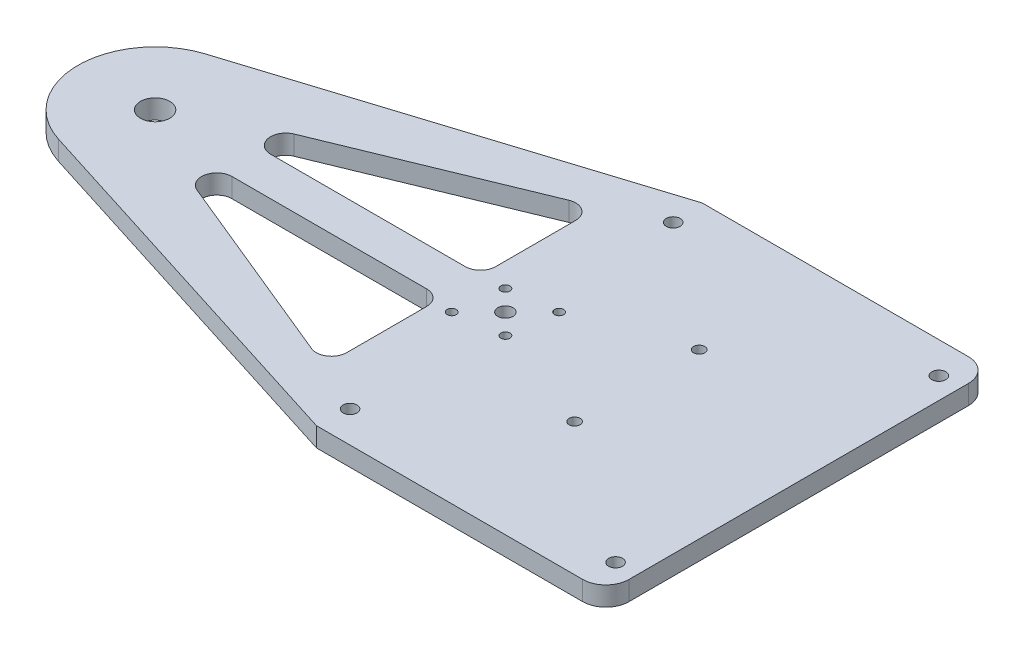
ISO-10303-21;
HEADER;
FILE_DESCRIPTION(('STEP AP214'),'2;1');
FILE_NAME('part.step','',(''),(''),'','','');
FILE_SCHEMA(('AUTOMOTIVE_DESIGN { 1 0 10303 214 1 1 1 1 }'));
ENDSEC;
DATA;
#1=APPLICATION_CONTEXT('core data for automotive mechanical design processes');
#2=APPLICATION_PROTOCOL_DEFINITION('international standard','automotive_design',2000,#1);
#3=PRODUCT_CONTEXT('',#1,'mechanical');
#4=PRODUCT('Part','Part','',(#3));
#5=PRODUCT_RELATED_PRODUCT_CATEGORY('part','',(#4));
#6=PRODUCT_DEFINITION_FORMATION('','',#4);
#7=PRODUCT_DEFINITION_CONTEXT('part definition',#1,'design');
#8=PRODUCT_DEFINITION('design','',#6,#7);
#9=PRODUCT_DEFINITION_SHAPE('','',#8);
#10=(LENGTH_UNIT() NAMED_UNIT(*) SI_UNIT(.MILLI.,.METRE.));
#11=(NAMED_UNIT(*) PLANE_ANGLE_UNIT() SI_UNIT($,.RADIAN.));
#12=(NAMED_UNIT(*) SI_UNIT($,.STERADIAN.) SOLID_ANGLE_UNIT());
#13=UNCERTAINTY_MEASURE_WITH_UNIT(LENGTH_MEASURE(1.E-05),#10,'distance_accuracy_value','');
#14=(GEOMETRIC_REPRESENTATION_CONTEXT(3) GLOBAL_UNCERTAINTY_ASSIGNED_CONTEXT((#13)) GLOBAL_UNIT_ASSIGNED_CONTEXT((#10,
#11,#12)) REPRESENTATION_CONTEXT('',''));
#15=CARTESIAN_POINT('',(0.,0.,0.));
#16=DIRECTION('',(0.,0.,1.));
#17=DIRECTION('',(1.,0.,0.));
#18=AXIS2_PLACEMENT_3D('',#15,#16,#17);
#19=CARTESIAN_POINT('',(47.625,6.35,63.5));
#20=DIRECTION('',(-1.,0.,0.));
#21=DIRECTION('',(0.,0.,1.));
#22=AXIS2_PLACEMENT_3D('',#19,#20,#21);
#23=PLANE('',#22);
#24=DIRECTION('',(0.,0.,-1.));
#25=VECTOR('',#24,1.);
#26=CARTESIAN_POINT('',(47.625,6.35,63.5));
#27=LINE('',#26,#25);
#28=CARTESIAN_POINT('',(47.625,6.35,55.88));
#29=VERTEX_POINT('',#28);
#30=CARTESIAN_POINT('',(47.625,6.35,-55.88));
#31=VERTEX_POINT('',#30);
#32=EDGE_CURVE('E225',#29,#31,#27,.T.);
#33=ORIENTED_EDGE('',*,*,#32,.F.);
#34=DIRECTION('',(0.,-1.,0.));
#35=VECTOR('',#34,1.);
#36=CARTESIAN_POINT('',(47.625,6.35,55.88));
#37=LINE('',#36,#35);
#38=CARTESIAN_POINT('',(47.625,0.,55.88));
#39=VERTEX_POINT('',#38);
#40=EDGE_CURVE('E290',#29,#39,#37,.T.);
#41=ORIENTED_EDGE('',*,*,#40,.T.);
#42=DIRECTION('',(0.,0.,-1.));
#43=VECTOR('',#42,1.);
#44=CARTESIAN_POINT('',(47.625,0.,63.5));
#45=LINE('',#44,#43);
#46=CARTESIAN_POINT('',(47.625,0.,-55.88));
#47=VERTEX_POINT('',#46);
#48=EDGE_CURVE('E187',#39,#47,#45,.T.);
#49=ORIENTED_EDGE('',*,*,#48,.T.);
#50=DIRECTION('',(0.,-1.,0.));
#51=VECTOR('',#50,1.);
#52=CARTESIAN_POINT('',(47.625,6.35,-55.88));
#53=LINE('',#52,#51);
#54=EDGE_CURVE('E288',#47,#31,#53,.F.);
#55=ORIENTED_EDGE('',*,*,#54,.T.);
#56=EDGE_LOOP('',(#33,#41,#49,#55));
#57=FACE_BOUND('',#56,.T.);
#58=ADVANCED_FACE('F39',(#57),#23,.F.);
#59=CARTESIAN_POINT('',(-47.625,6.35,-63.5));
#60=DIRECTION('',(0.,0.,1.));
#61=DIRECTION('',(1.,0.,0.));
#62=AXIS2_PLACEMENT_3D('',#59,#60,#61);
#63=PLANE('',#62);
#64=DIRECTION('',(-1.,0.,0.));
#65=VECTOR('',#64,1.);
#66=CARTESIAN_POINT('',(-47.625,6.35,-63.5));
#67=LINE('',#66,#65);
#68=CARTESIAN_POINT('',(40.005,6.35,-63.5));
#69=VERTEX_POINT('',#68);
#70=CARTESIAN_POINT('',(-47.625,6.35,-63.5));
#71=VERTEX_POINT('',#70);
#72=EDGE_CURVE('E227',#69,#71,#67,.T.);
#73=ORIENTED_EDGE('',*,*,#72,.F.);
#74=DIRECTION('',(0.,-1.,0.));
#75=VECTOR('',#74,1.);
#76=CARTESIAN_POINT('',(40.005,6.35,-63.5));
#77=LINE('',#76,#75);
#78=CARTESIAN_POINT('',(40.005,0.,-63.5));
#79=VERTEX_POINT('',#78);
#80=EDGE_CURVE('E11',#69,#79,#77,.T.);
#81=ORIENTED_EDGE('',*,*,#80,.T.);
#82=DIRECTION('',(-1.,0.,0.));
#83=VECTOR('',#82,1.);
#84=CARTESIAN_POINT('',(-47.625,0.,-63.5));
#85=LINE('',#84,#83);
#86=CARTESIAN_POINT('',(-47.625,0.,-63.5));
#87=VERTEX_POINT('',#86);
#88=EDGE_CURVE('E178',#79,#87,#85,.T.);
#89=ORIENTED_EDGE('',*,*,#88,.T.);
#90=DIRECTION('',(0.,-1.,0.));
#91=VECTOR('',#90,1.);
#92=CARTESIAN_POINT('',(-47.625,6.35,-63.5));
#93=LINE('',#92,#91);
#94=EDGE_CURVE('E181',#71,#87,#93,.T.);
#95=ORIENTED_EDGE('',*,*,#94,.F.);
#96=EDGE_LOOP('',(#73,#81,#89,#95));
#97=FACE_BOUND('',#96,.T.);
#98=ADVANCED_FACE('F180',(#97),#63,.F.);
#99=CARTESIAN_POINT('',(-47.625,6.35,63.5));
#100=DIRECTION('',(0.,0.,-1.));
#101=DIRECTION('',(-1.,0.,0.));
#102=AXIS2_PLACEMENT_3D('',#99,#100,#101);
#103=PLANE('',#102);
#104=DIRECTION('',(1.,0.,0.));
#105=VECTOR('',#104,1.);
#106=CARTESIAN_POINT('',(-47.625,0.,63.5));
#107=LINE('',#106,#105);
#108=CARTESIAN_POINT('',(-47.625,0.,63.5));
#109=VERTEX_POINT('',#108);
#110=CARTESIAN_POINT('',(40.005,0.,63.5));
#111=VERTEX_POINT('',#110);
#112=EDGE_CURVE('E186',#109,#111,#107,.T.);
#113=ORIENTED_EDGE('',*,*,#112,.T.);
#114=DIRECTION('',(0.,-1.,0.));
#115=VECTOR('',#114,1.);
#116=CARTESIAN_POINT('',(40.005,6.35,63.5));
#117=LINE('',#116,#115);
#118=CARTESIAN_POINT('',(40.005,6.35,63.5));
#119=VERTEX_POINT('',#118);
#120=EDGE_CURVE('E62',#111,#119,#117,.F.);
#121=ORIENTED_EDGE('',*,*,#120,.T.);
#122=DIRECTION('',(1.,0.,0.));
#123=VECTOR('',#122,1.);
#124=CARTESIAN_POINT('',(-47.625,6.35,63.5));
#125=LINE('',#124,#123);
#126=CARTESIAN_POINT('',(-47.625,6.35,63.5));
#127=VERTEX_POINT('',#126);
#128=EDGE_CURVE('E229',#127,#119,#125,.T.);
#129=ORIENTED_EDGE('',*,*,#128,.F.);
#130=DIRECTION('',(0.,-1.,0.));
#131=VECTOR('',#130,1.);
#132=CARTESIAN_POINT('',(-47.625,6.35,63.5));
#133=LINE('',#132,#131);
#134=EDGE_CURVE('E196',#127,#109,#133,.T.);
#135=ORIENTED_EDGE('',*,*,#134,.T.);
#136=EDGE_LOOP('',(#113,#121,#129,#135));
#137=FACE_BOUND('',#136,.T.);
#138=ADVANCED_FACE('F307',(#137),#103,.F.);
#139=CARTESIAN_POINT('',(0.,6.35,0.));
#140=DIRECTION('',(0.,-1.,0.));
#141=DIRECTION('',(0.,0.,-1.));
#142=AXIS2_PLACEMENT_3D('',#139,#140,#141);
#143=PLANE('',#142);
#144=CARTESIAN_POINT('',(-6.32846504664037,6.35,19.8289248425364));
#145=DIRECTION('',(0.,1.,0.));
#146=DIRECTION('',(0.,0.,1.));
#147=AXIS2_PLACEMENT_3D('',#144,#145,#146);
#148=CIRCLE('',#147,1.83000808299);
#149=CARTESIAN_POINT('',(-6.32846504664037,6.35,21.6589329255264));
#150=VERTEX_POINT('',#149);
#151=EDGE_CURVE('E531',#150,#150,#148,.T.);
#152=ORIENTED_EDGE('',*,*,#151,.F.);
#153=EDGE_LOOP('',(#152));
#154=FACE_BOUND('',#153,.T.);
#155=CARTESIAN_POINT('',(-6.32833804564912,6.35,-21.1714909607088));
#156=DIRECTION('',(0.,1.,0.));
#157=DIRECTION('',(0.,0.,1.));
#158=AXIS2_PLACEMENT_3D('',#155,#156,#157);
#159=CIRCLE('',#158,1.83000808299);
#160=CARTESIAN_POINT('',(-6.32833804564912,6.35,-19.3414828777188));
#161=VERTEX_POINT('',#160);
#162=EDGE_CURVE('E525',#161,#161,#159,.T.);
#163=ORIENTED_EDGE('',*,*,#162,.F.);
#164=EDGE_LOOP('',(#163));
#165=FACE_BOUND('',#164,.T.);
#166=CARTESIAN_POINT('',(40.53961409898,6.35,53.2203604808211));
#167=DIRECTION('',(0.,1.,0.));
#168=DIRECTION('',(0.,0.,1.));
#169=AXIS2_PLACEMENT_3D('',#166,#167,#168);
#170=CIRCLE('',#169,2.2812375);
#171=CARTESIAN_POINT('',(40.53961409898,6.35,55.5015979808211));
#172=VERTEX_POINT('',#171);
#173=EDGE_CURVE('E507',#172,#172,#170,.T.);
#174=ORIENTED_EDGE('',*,*,#173,.F.);
#175=EDGE_LOOP('',(#174));
#176=FACE_BOUND('',#175,.T.);
#177=CARTESIAN_POINT('',(40.5570335523335,6.35,-53.1901891025738));
#178=DIRECTION('',(0.,1.,0.));
#179=DIRECTION('',(0.,0.,1.));
#180=AXIS2_PLACEMENT_3D('',#177,#178,#179);
#181=CIRCLE('',#180,2.2812375);
#182=CARTESIAN_POINT('',(40.5570335523335,6.35,-50.9089516025738));
#183=VERTEX_POINT('',#182);
#184=EDGE_CURVE('E514',#183,#183,#181,.T.);
#185=ORIENTED_EDGE('',*,*,#184,.F.);
#186=EDGE_LOOP('',(#185));
#187=FACE_BOUND('',#186,.T.);
#188=CARTESIAN_POINT('',(-46.8896140989806,6.35,-53.1801319764913));
#189=DIRECTION('',(0.,1.,0.));
#190=DIRECTION('',(0.,0.,1.));
#191=AXIS2_PLACEMENT_3D('',#188,#189,#190);
#192=CIRCLE('',#191,2.2812375);
#193=CARTESIAN_POINT('',(-46.8896140989806,6.35,-50.8988944764913));
#194=VERTEX_POINT('',#193);
#195=EDGE_CURVE('E520',#194,#194,#192,.T.);
#196=ORIENTED_EDGE('',*,*,#195,.F.);
#197=EDGE_LOOP('',(#196));
#198=FACE_BOUND('',#197,.T.);
#199=CARTESIAN_POINT('',(-46.8896140989806,6.35,53.2002462286562));
#200=DIRECTION('',(0.,1.,0.));
#201=DIRECTION('',(0.,0.,1.));
#202=AXIS2_PLACEMENT_3D('',#199,#200,#201);
#203=CIRCLE('',#202,2.2812375);
#204=CARTESIAN_POINT('',(-46.8896140989806,6.35,55.4814837286562));
#205=VERTEX_POINT('',#204);
#206=EDGE_CURVE('E501',#205,#205,#203,.T.);
#207=ORIENTED_EDGE('',*,*,#206,.F.);
#208=EDGE_LOOP('',(#207));
#209=FACE_BOUND('',#208,.T.);
#210=DIRECTION('',(-0.924890770713384,0.,0.380232905268865));
#211=VECTOR('',#210,1.);
#212=CARTESIAN_POINT('',(-63.5,6.35,-45.1637433547681));
#213=LINE('',#212,#211);
#214=CARTESIAN_POINT('',(-70.4011645263443,6.35,-42.3265976931606));
#215=VERTEX_POINT('',#214);
#216=CARTESIAN_POINT('',(-134.500968325591,6.35,-15.9744538535669));
#217=VERTEX_POINT('',#216);
#218=EDGE_CURVE('E489',#215,#217,#213,.T.);
#219=ORIENTED_EDGE('',*,*,#218,.F.);
#220=CARTESIAN_POINT('',(-68.5,6.35,-37.7021438395937));
#221=DIRECTION('',(0.,-1.,0.));
#222=DIRECTION('',(0.,0.,-1.));
#223=AXIS2_PLACEMENT_3D('',#220,#221,#222);
#224=CIRCLE('',#223,5.);
#225=CARTESIAN_POINT('',(-63.5,6.35,-37.7021438395937));
#226=VERTEX_POINT('',#225);
#227=EDGE_CURVE('E284',#215,#226,#224,.T.);
#228=ORIENTED_EDGE('',*,*,#227,.T.);
#229=DIRECTION('',(0.,0.,-1.));
#230=VECTOR('',#229,1.);
#231=CARTESIAN_POINT('',(-63.5,6.35,-6.34999999999999));
#232=LINE('',#231,#230);
#233=CARTESIAN_POINT('',(-63.5,6.35,-11.35));
#234=VERTEX_POINT('',#233);
#235=EDGE_CURVE('E479',#234,#226,#232,.T.);
#236=ORIENTED_EDGE('',*,*,#235,.F.);
#237=CARTESIAN_POINT('',(-68.5,6.35,-11.35));
#238=DIRECTION('',(0.,-1.,0.));
#239=DIRECTION('',(0.,0.,-1.));
#240=AXIS2_PLACEMENT_3D('',#237,#238,#239);
#241=CIRCLE('',#240,5.);
#242=CARTESIAN_POINT('',(-68.5,6.35,-6.34999999999999));
#243=VERTEX_POINT('',#242);
#244=EDGE_CURVE('E276',#234,#243,#241,.T.);
#245=ORIENTED_EDGE('',*,*,#244,.T.);
#246=DIRECTION('',(1.,0.,0.));
#247=VECTOR('',#246,1.);
#248=CARTESIAN_POINT('',(-157.9118,6.35,-6.34999999999997));
#249=LINE('',#248,#247);
#250=CARTESIAN_POINT('',(-132.599803799247,6.35,-6.34999999999998));
#251=VERTEX_POINT('',#250);
#252=EDGE_CURVE('E485',#251,#243,#249,.T.);
#253=ORIENTED_EDGE('',*,*,#252,.F.);
#254=CARTESIAN_POINT('',(-132.599803799247,6.35,-11.35));
#255=DIRECTION('',(0.,-1.,0.));
#256=DIRECTION('',(0.,0.,-1.));
#257=AXIS2_PLACEMENT_3D('',#254,#255,#256);
#258=CIRCLE('',#257,5.);
#259=EDGE_CURVE('E280',#251,#217,#258,.T.);
#260=ORIENTED_EDGE('',*,*,#259,.T.);
#261=EDGE_LOOP('',(#219,#228,#236,#245,#253,#260));
#262=FACE_BOUND('',#261,.T.);
#263=DIRECTION('',(0.924890770713385,0.,0.380232905268865));
#264=VECTOR('',#263,1.);
#265=CARTESIAN_POINT('',(-63.5,6.35,45.1637433547681));
#266=LINE('',#265,#264);
#267=CARTESIAN_POINT('',(-134.500968325591,6.35,15.9744538535669));
#268=VERTEX_POINT('',#267);
#269=CARTESIAN_POINT('',(-70.4011645263443,6.35,42.3265976931606));
#270=VERTEX_POINT('',#269);
#271=EDGE_CURVE('E469',#268,#270,#266,.T.);
#272=ORIENTED_EDGE('',*,*,#271,.F.);
#273=CARTESIAN_POINT('',(-132.599803799247,6.35,11.35));
#274=DIRECTION('',(0.,-1.,0.));
#275=DIRECTION('',(0.,0.,-1.));
#276=AXIS2_PLACEMENT_3D('',#273,#274,#275);
#277=CIRCLE('',#276,5.);
#278=CARTESIAN_POINT('',(-132.599803799247,6.35,6.35000000000001));
#279=VERTEX_POINT('',#278);
#280=EDGE_CURVE('E264',#268,#279,#277,.T.);
#281=ORIENTED_EDGE('',*,*,#280,.T.);
#282=DIRECTION('',(-1.,0.,0.));
#283=VECTOR('',#282,1.);
#284=CARTESIAN_POINT('',(-157.9118,6.35,6.35000000000001));
#285=LINE('',#284,#283);
#286=CARTESIAN_POINT('',(-68.5,6.35,6.35000000000001));
#287=VERTEX_POINT('',#286);
#288=EDGE_CURVE('E472',#287,#279,#285,.T.);
#289=ORIENTED_EDGE('',*,*,#288,.F.);
#290=CARTESIAN_POINT('',(-68.5,6.35,11.35));
#291=DIRECTION('',(0.,-1.,0.));
#292=DIRECTION('',(0.,0.,-1.));
#293=AXIS2_PLACEMENT_3D('',#290,#291,#292);
#294=CIRCLE('',#293,5.);
#295=CARTESIAN_POINT('',(-63.5,6.35,11.35));
#296=VERTEX_POINT('',#295);
#297=EDGE_CURVE('E268',#287,#296,#294,.T.);
#298=ORIENTED_EDGE('',*,*,#297,.T.);
#299=DIRECTION('',(0.,0.,-1.));
#300=VECTOR('',#299,1.);
#301=CARTESIAN_POINT('',(-63.5,6.35,6.35000000000001));
#302=LINE('',#301,#300);
#303=CARTESIAN_POINT('',(-63.5,6.35,37.7021438395937));
#304=VERTEX_POINT('',#303);
#305=EDGE_CURVE('E465',#304,#296,#302,.T.);
#306=ORIENTED_EDGE('',*,*,#305,.F.);
#307=CARTESIAN_POINT('',(-68.5,6.35,37.7021438395937));
#308=DIRECTION('',(0.,-1.,0.));
#309=DIRECTION('',(0.,0.,-1.));
#310=AXIS2_PLACEMENT_3D('',#307,#308,#309);
#311=CIRCLE('',#310,5.);
#312=EDGE_CURVE('E272',#304,#270,#311,.T.);
#313=ORIENTED_EDGE('',*,*,#312,.T.);
#314=EDGE_LOOP('',(#272,#281,#289,#298,#306,#313));
#315=FACE_BOUND('',#314,.T.);
#316=CARTESIAN_POINT('',(-164.2618,6.35,0.));
#317=DIRECTION('',(0.,1.,0.));
#318=DIRECTION('',(0.,0.,1.));
#319=AXIS2_PLACEMENT_3D('',#316,#317,#318);
#320=CIRCLE('',#319,4.82599999999999);
#321=CARTESIAN_POINT('',(-164.2618,6.35,4.82599999999999));
#322=VERTEX_POINT('',#321);
#323=EDGE_CURVE('E454',#322,#322,#320,.T.);
#324=ORIENTED_EDGE('',*,*,#323,.F.);
#325=EDGE_LOOP('',(#324));
#326=FACE_BOUND('',#325,.T.);
#327=CARTESIAN_POINT('',(-42.2282855787278,6.35,6.71751442127221));
#328=DIRECTION('',(0.,1.,0.));
#329=DIRECTION('',(0.,0.,1.));
#330=AXIS2_PLACEMENT_3D('',#327,#328,#329);
#331=CIRCLE('',#330,1.50000000000004);
#332=CARTESIAN_POINT('',(-42.2282855787278,6.35,8.21751442127225));
#333=VERTEX_POINT('',#332);
#334=EDGE_CURVE('E438',#333,#333,#331,.T.);
#335=ORIENTED_EDGE('',*,*,#334,.F.);
#336=EDGE_LOOP('',(#335));
#337=FACE_BOUND('',#336,.T.);
#338=CARTESIAN_POINT('',(-55.6633144212722,6.35,-6.71751442127223));
#339=DIRECTION('',(0.,1.,0.));
#340=DIRECTION('',(0.,0.,1.));
#341=AXIS2_PLACEMENT_3D('',#338,#339,#340);
#342=CIRCLE('',#341,1.50000000000004);
#343=CARTESIAN_POINT('',(-55.6633144212722,6.35,-5.21751442127219));
#344=VERTEX_POINT('',#343);
#345=EDGE_CURVE('E432',#344,#344,#342,.T.);
#346=ORIENTED_EDGE('',*,*,#345,.F.);
#347=EDGE_LOOP('',(#346));
#348=FACE_BOUND('',#347,.T.);
#349=CARTESIAN_POINT('',(-57.7846347648318,6.35,8.83883476483181));
#350=DIRECTION('',(0.,1.,0.));
#351=DIRECTION('',(0.,0.,1.));
#352=AXIS2_PLACEMENT_3D('',#349,#350,#351);
#353=CIRCLE('',#352,1.50000000000004);
#354=CARTESIAN_POINT('',(-57.7846347648318,6.35,10.3388347648319));
#355=VERTEX_POINT('',#354);
#356=EDGE_CURVE('E436',#355,#355,#353,.T.);
#357=ORIENTED_EDGE('',*,*,#356,.F.);
#358=EDGE_LOOP('',(#357));
#359=FACE_BOUND('',#358,.T.);
#360=CARTESIAN_POINT('',(-40.1069652351681,6.35,-8.83883476483183));
#361=DIRECTION('',(0.,1.,0.));
#362=DIRECTION('',(0.,0.,1.));
#363=AXIS2_PLACEMENT_3D('',#360,#361,#362);
#364=CIRCLE('',#363,1.50000000000004);
#365=CARTESIAN_POINT('',(-40.1069652351681,6.35,-7.33883476483179));
#366=VERTEX_POINT('',#365);
#367=EDGE_CURVE('E445',#366,#366,#364,.T.);
#368=ORIENTED_EDGE('',*,*,#367,.F.);
#369=EDGE_LOOP('',(#368));
#370=FACE_BOUND('',#369,.T.);
#371=CARTESIAN_POINT('',(-48.9458,6.35,0.));
#372=DIRECTION('',(0.,1.,0.));
#373=DIRECTION('',(0.,0.,1.));
#374=AXIS2_PLACEMENT_3D('',#371,#372,#373);
#375=CIRCLE('',#374,2.5);
#376=CARTESIAN_POINT('',(-48.9458,6.35,2.5));
#377=VERTEX_POINT('',#376);
#378=EDGE_CURVE('E451',#377,#377,#375,.T.);
#379=ORIENTED_EDGE('',*,*,#378,.F.);
#380=EDGE_LOOP('',(#379));
#381=FACE_BOUND('',#380,.T.);
#382=ORIENTED_EDGE('',*,*,#128,.T.);
#383=CARTESIAN_POINT('',(40.005,6.35,55.88));
#384=DIRECTION('',(0.,-1.,0.));
#385=DIRECTION('',(0.,0.,-1.));
#386=AXIS2_PLACEMENT_3D('',#383,#384,#385);
#387=CIRCLE('',#386,7.62);
#388=EDGE_CURVE('E47',#119,#29,#387,.F.);
#389=ORIENTED_EDGE('',*,*,#388,.T.);
#390=ORIENTED_EDGE('',*,*,#32,.T.);
#391=CARTESIAN_POINT('',(40.005,6.35,-55.88));
#392=DIRECTION('',(0.,-1.,0.));
#393=DIRECTION('',(0.,0.,-1.));
#394=AXIS2_PLACEMENT_3D('',#391,#392,#393);
#395=CIRCLE('',#394,7.62);
#396=EDGE_CURVE('E54',#31,#69,#395,.F.);
#397=ORIENTED_EDGE('',*,*,#396,.T.);
#398=ORIENTED_EDGE('',*,*,#72,.T.);
#399=DIRECTION('',(-0.953514489025035,0.,0.301347173903003));
#400=VECTOR('',#399,1.);
#401=CARTESIAN_POINT('',(-47.625,6.35,-63.5));
#402=LINE('',#401,#400);
#403=CARTESIAN_POINT('',(-171.916018217136,6.35,-24.2192680212359));
#404=VERTEX_POINT('',#403);
#405=EDGE_CURVE('E194',#71,#404,#402,.T.);
#406=ORIENTED_EDGE('',*,*,#405,.T.);
#407=CARTESIAN_POINT('',(-164.2618,6.35,0.));
#408=DIRECTION('',(0.,1.,0.));
#409=DIRECTION('',(0.,0.,1.));
#410=AXIS2_PLACEMENT_3D('',#407,#408,#409);
#411=CIRCLE('',#410,25.4);
#412=CARTESIAN_POINT('',(-171.916018217136,6.35,24.2192680212359));
#413=VERTEX_POINT('',#412);
#414=EDGE_CURVE('E209',#404,#413,#411,.T.);
#415=ORIENTED_EDGE('',*,*,#414,.T.);
#416=DIRECTION('',(0.953514489025035,0.,0.301347173903003));
#417=VECTOR('',#416,1.);
#418=CARTESIAN_POINT('',(-47.625,6.35,63.5));
#419=LINE('',#418,#417);
#420=EDGE_CURVE('E204',#413,#127,#419,.T.);
#421=ORIENTED_EDGE('',*,*,#420,.T.);
#422=EDGE_LOOP('',(#382,#389,#390,#397,#398,#406,#415,#421));
#423=FACE_BOUND('',#422,.T.);
#424=ADVANCED_FACE('F300',(#154,#165,#176,#187,#198,#209,#262,#315,#326,#337,#348,#359,#370,
#381,#423),#143,.F.);
#425=CARTESIAN_POINT('',(0.,0.,0.));
#426=DIRECTION('',(0.,-1.,0.));
#427=DIRECTION('',(0.,0.,-1.));
#428=AXIS2_PLACEMENT_3D('',#425,#426,#427);
#429=PLANE('',#428);
#430=CARTESIAN_POINT('',(-6.32846504664037,0.,19.8289248425364));
#431=DIRECTION('',(0.,1.,0.));
#432=DIRECTION('',(0.,0.,1.));
#433=AXIS2_PLACEMENT_3D('',#430,#431,#432);
#434=CIRCLE('',#433,1.83000808299);
#435=CARTESIAN_POINT('',(-6.32846504664037,0.,21.6589329255264));
#436=VERTEX_POINT('',#435);
#437=EDGE_CURVE('E511',#436,#436,#434,.T.);
#438=ORIENTED_EDGE('',*,*,#437,.T.);
#439=EDGE_LOOP('',(#438));
#440=FACE_BOUND('',#439,.T.);
#441=CARTESIAN_POINT('',(-6.32833804564912,0.,-21.1714909607088));
#442=DIRECTION('',(0.,1.,0.));
#443=DIRECTION('',(0.,0.,1.));
#444=AXIS2_PLACEMENT_3D('',#441,#442,#443);
#445=CIRCLE('',#444,1.83000808299);
#446=CARTESIAN_POINT('',(-6.32833804564912,0.,-19.3414828777188));
#447=VERTEX_POINT('',#446);
#448=EDGE_CURVE('E528',#447,#447,#445,.T.);
#449=ORIENTED_EDGE('',*,*,#448,.T.);
#450=EDGE_LOOP('',(#449));
#451=FACE_BOUND('',#450,.T.);
#452=CARTESIAN_POINT('',(40.53961409898,0.,53.2203604808211));
#453=DIRECTION('',(0.,1.,0.));
#454=DIRECTION('',(0.,0.,1.));
#455=AXIS2_PLACEMENT_3D('',#452,#453,#454);
#456=CIRCLE('',#455,2.2812375);
#457=CARTESIAN_POINT('',(40.53961409898,0.,55.5015979808211));
#458=VERTEX_POINT('',#457);
#459=EDGE_CURVE('E510',#458,#458,#456,.T.);
#460=ORIENTED_EDGE('',*,*,#459,.T.);
#461=EDGE_LOOP('',(#460));
#462=FACE_BOUND('',#461,.T.);
#463=CARTESIAN_POINT('',(40.5570335523335,0.,-53.1901891025738));
#464=DIRECTION('',(0.,1.,0.));
#465=DIRECTION('',(0.,0.,1.));
#466=AXIS2_PLACEMENT_3D('',#463,#464,#465);
#467=CIRCLE('',#466,2.2812375);
#468=CARTESIAN_POINT('',(40.5570335523335,0.,-50.9089516025738));
#469=VERTEX_POINT('',#468);
#470=EDGE_CURVE('E517',#469,#469,#467,.T.);
#471=ORIENTED_EDGE('',*,*,#470,.T.);
#472=EDGE_LOOP('',(#471));
#473=FACE_BOUND('',#472,.T.);
#474=CARTESIAN_POINT('',(-46.8896140989806,0.,-53.1801319764913));
#475=DIRECTION('',(0.,1.,0.));
#476=DIRECTION('',(0.,0.,1.));
#477=AXIS2_PLACEMENT_3D('',#474,#475,#476);
#478=CIRCLE('',#477,2.2812375);
#479=CARTESIAN_POINT('',(-46.8896140989806,0.,-50.8988944764913));
#480=VERTEX_POINT('',#479);
#481=EDGE_CURVE('E504',#480,#480,#478,.T.);
#482=ORIENTED_EDGE('',*,*,#481,.T.);
#483=EDGE_LOOP('',(#482));
#484=FACE_BOUND('',#483,.T.);
#485=CARTESIAN_POINT('',(-46.8896140989806,0.,53.2002462286562));
#486=DIRECTION('',(0.,1.,0.));
#487=DIRECTION('',(0.,0.,1.));
#488=AXIS2_PLACEMENT_3D('',#485,#486,#487);
#489=CIRCLE('',#488,2.2812375);
#490=CARTESIAN_POINT('',(-46.8896140989806,0.,55.4814837286562));
#491=VERTEX_POINT('',#490);
#492=EDGE_CURVE('E475',#491,#491,#489,.T.);
#493=ORIENTED_EDGE('',*,*,#492,.T.);
#494=EDGE_LOOP('',(#493));
#495=FACE_BOUND('',#494,.T.);
#496=DIRECTION('',(1.,0.,0.));
#497=VECTOR('',#496,1.);
#498=CARTESIAN_POINT('',(-157.9118,0.,-6.34999999999997));
#499=LINE('',#498,#497);
#500=CARTESIAN_POINT('',(-132.599803799247,0.,-6.34999999999998));
#501=VERTEX_POINT('',#500);
#502=CARTESIAN_POINT('',(-68.5,0.,-6.34999999999999));
#503=VERTEX_POINT('',#502);
#504=EDGE_CURVE('E458',#501,#503,#499,.T.);
#505=ORIENTED_EDGE('',*,*,#504,.T.);
#506=CARTESIAN_POINT('',(-68.5,0.,-11.35));
#507=DIRECTION('',(0.,-1.,0.));
#508=DIRECTION('',(0.,0.,-1.));
#509=AXIS2_PLACEMENT_3D('',#506,#507,#508);
#510=CIRCLE('',#509,5.);
#511=CARTESIAN_POINT('',(-63.5,0.,-11.35));
#512=VERTEX_POINT('',#511);
#513=EDGE_CURVE('E278',#503,#512,#510,.F.);
#514=ORIENTED_EDGE('',*,*,#513,.T.);
#515=DIRECTION('',(0.,0.,-1.));
#516=VECTOR('',#515,1.);
#517=CARTESIAN_POINT('',(-63.5,0.,-6.34999999999999));
#518=LINE('',#517,#516);
#519=CARTESIAN_POINT('',(-63.5,0.,-37.7021438395937));
#520=VERTEX_POINT('',#519);
#521=EDGE_CURVE('E488',#512,#520,#518,.T.);
#522=ORIENTED_EDGE('',*,*,#521,.T.);
#523=CARTESIAN_POINT('',(-68.5,0.,-37.7021438395937));
#524=DIRECTION('',(0.,-1.,0.));
#525=DIRECTION('',(0.,0.,-1.));
#526=AXIS2_PLACEMENT_3D('',#523,#524,#525);
#527=CIRCLE('',#526,5.);
#528=CARTESIAN_POINT('',(-70.4011645263443,0.,-42.3265976931606));
#529=VERTEX_POINT('',#528);
#530=EDGE_CURVE('E286',#520,#529,#527,.F.);
#531=ORIENTED_EDGE('',*,*,#530,.T.);
#532=DIRECTION('',(-0.924890770713384,0.,0.380232905268865));
#533=VECTOR('',#532,1.);
#534=CARTESIAN_POINT('',(-63.5,0.,-45.1637433547681));
#535=LINE('',#534,#533);
#536=CARTESIAN_POINT('',(-134.500968325591,0.,-15.9744538535669));
#537=VERTEX_POINT('',#536);
#538=EDGE_CURVE('E496',#529,#537,#535,.T.);
#539=ORIENTED_EDGE('',*,*,#538,.T.);
#540=CARTESIAN_POINT('',(-132.599803799247,0.,-11.35));
#541=DIRECTION('',(0.,-1.,0.));
#542=DIRECTION('',(0.,0.,-1.));
#543=AXIS2_PLACEMENT_3D('',#540,#541,#542);
#544=CIRCLE('',#543,5.);
#545=EDGE_CURVE('E282',#537,#501,#544,.F.);
#546=ORIENTED_EDGE('',*,*,#545,.T.);
#547=EDGE_LOOP('',(#505,#514,#522,#531,#539,#546));
#548=FACE_BOUND('',#547,.T.);
#549=DIRECTION('',(0.,0.,-1.));
#550=VECTOR('',#549,1.);
#551=CARTESIAN_POINT('',(-63.5,0.,6.35000000000001));
#552=LINE('',#551,#550);
#553=CARTESIAN_POINT('',(-63.5,0.,37.7021438395937));
#554=VERTEX_POINT('',#553);
#555=CARTESIAN_POINT('',(-63.5,0.,11.35));
#556=VERTEX_POINT('',#555);
#557=EDGE_CURVE('E476',#554,#556,#552,.T.);
#558=ORIENTED_EDGE('',*,*,#557,.T.);
#559=CARTESIAN_POINT('',(-68.5,0.,11.35));
#560=DIRECTION('',(0.,-1.,0.));
#561=DIRECTION('',(0.,0.,-1.));
#562=AXIS2_PLACEMENT_3D('',#559,#560,#561);
#563=CIRCLE('',#562,5.);
#564=CARTESIAN_POINT('',(-68.5,0.,6.35000000000001));
#565=VERTEX_POINT('',#564);
#566=EDGE_CURVE('E270',#556,#565,#563,.F.);
#567=ORIENTED_EDGE('',*,*,#566,.T.);
#568=DIRECTION('',(-1.,0.,0.));
#569=VECTOR('',#568,1.);
#570=CARTESIAN_POINT('',(-157.9118,0.,6.35000000000001));
#571=LINE('',#570,#569);
#572=CARTESIAN_POINT('',(-132.599803799247,0.,6.35000000000001));
#573=VERTEX_POINT('',#572);
#574=EDGE_CURVE('E468',#565,#573,#571,.T.);
#575=ORIENTED_EDGE('',*,*,#574,.T.);
#576=CARTESIAN_POINT('',(-132.599803799247,0.,11.35));
#577=DIRECTION('',(0.,-1.,0.));
#578=DIRECTION('',(0.,0.,-1.));
#579=AXIS2_PLACEMENT_3D('',#576,#577,#578);
#580=CIRCLE('',#579,5.);
#581=CARTESIAN_POINT('',(-134.500968325591,0.,15.9744538535669));
#582=VERTEX_POINT('',#581);
#583=EDGE_CURVE('E266',#573,#582,#580,.F.);
#584=ORIENTED_EDGE('',*,*,#583,.T.);
#585=DIRECTION('',(0.924890770713385,0.,0.380232905268865));
#586=VECTOR('',#585,1.);
#587=CARTESIAN_POINT('',(-63.5,0.,45.1637433547681));
#588=LINE('',#587,#586);
#589=CARTESIAN_POINT('',(-70.4011645263443,0.,42.3265976931606));
#590=VERTEX_POINT('',#589);
#591=EDGE_CURVE('E480',#582,#590,#588,.T.);
#592=ORIENTED_EDGE('',*,*,#591,.T.);
#593=CARTESIAN_POINT('',(-68.5,0.,37.7021438395937));
#594=DIRECTION('',(0.,-1.,0.));
#595=DIRECTION('',(0.,0.,-1.));
#596=AXIS2_PLACEMENT_3D('',#593,#594,#595);
#597=CIRCLE('',#596,5.);
#598=EDGE_CURVE('E274',#590,#554,#597,.F.);
#599=ORIENTED_EDGE('',*,*,#598,.T.);
#600=EDGE_LOOP('',(#558,#567,#575,#584,#592,#599));
#601=FACE_BOUND('',#600,.T.);
#602=CARTESIAN_POINT('',(-164.2618,0.,0.));
#603=DIRECTION('',(0.,1.,0.));
#604=DIRECTION('',(0.,0.,1.));
#605=AXIS2_PLACEMENT_3D('',#602,#603,#604);
#606=CIRCLE('',#605,4.82599999999999);
#607=CARTESIAN_POINT('',(-164.2618,0.,4.82599999999999));
#608=VERTEX_POINT('',#607);
#609=EDGE_CURVE('E219',#608,#608,#606,.T.);
#610=ORIENTED_EDGE('',*,*,#609,.T.);
#611=EDGE_LOOP('',(#610));
#612=FACE_BOUND('',#611,.T.);
#613=CARTESIAN_POINT('',(-42.2282855787278,0.,6.71751442127221));
#614=DIRECTION('',(0.,1.,0.));
#615=DIRECTION('',(0.,0.,1.));
#616=AXIS2_PLACEMENT_3D('',#613,#614,#615);
#617=CIRCLE('',#616,1.50000000000004);
#618=CARTESIAN_POINT('',(-42.2282855787278,0.,8.21751442127225));
#619=VERTEX_POINT('',#618);
#620=EDGE_CURVE('E455',#619,#619,#617,.T.);
#621=ORIENTED_EDGE('',*,*,#620,.T.);
#622=EDGE_LOOP('',(#621));
#623=FACE_BOUND('',#622,.T.);
#624=CARTESIAN_POINT('',(-55.6633144212722,0.,-6.71751442127223));
#625=DIRECTION('',(0.,1.,0.));
#626=DIRECTION('',(0.,0.,1.));
#627=AXIS2_PLACEMENT_3D('',#624,#625,#626);
#628=CIRCLE('',#627,1.50000000000004);
#629=CARTESIAN_POINT('',(-55.6633144212722,0.,-5.21751442127219));
#630=VERTEX_POINT('',#629);
#631=EDGE_CURVE('E212',#630,#630,#628,.T.);
#632=ORIENTED_EDGE('',*,*,#631,.T.);
#633=EDGE_LOOP('',(#632));
#634=FACE_BOUND('',#633,.T.);
#635=CARTESIAN_POINT('',(-57.7846347648318,0.,8.83883476483181));
#636=DIRECTION('',(0.,1.,0.));
#637=DIRECTION('',(0.,0.,1.));
#638=AXIS2_PLACEMENT_3D('',#635,#636,#637);
#639=CIRCLE('',#638,1.50000000000004);
#640=CARTESIAN_POINT('',(-57.7846347648318,0.,10.3388347648319));
#641=VERTEX_POINT('',#640);
#642=EDGE_CURVE('E434',#641,#641,#639,.T.);
#643=ORIENTED_EDGE('',*,*,#642,.T.);
#644=EDGE_LOOP('',(#643));
#645=FACE_BOUND('',#644,.T.);
#646=CARTESIAN_POINT('',(-40.1069652351681,0.,-8.83883476483183));
#647=DIRECTION('',(0.,1.,0.));
#648=DIRECTION('',(0.,0.,1.));
#649=AXIS2_PLACEMENT_3D('',#646,#647,#648);
#650=CIRCLE('',#649,1.50000000000004);
#651=CARTESIAN_POINT('',(-40.1069652351681,0.,-7.33883476483179));
#652=VERTEX_POINT('',#651);
#653=EDGE_CURVE('E442',#652,#652,#650,.T.);
#654=ORIENTED_EDGE('',*,*,#653,.T.);
#655=EDGE_LOOP('',(#654));
#656=FACE_BOUND('',#655,.T.);
#657=CARTESIAN_POINT('',(-48.9458,0.,0.));
#658=DIRECTION('',(0.,1.,0.));
#659=DIRECTION('',(0.,0.,1.));
#660=AXIS2_PLACEMENT_3D('',#657,#658,#659);
#661=CIRCLE('',#660,2.5);
#662=CARTESIAN_POINT('',(-48.9458,0.,2.5));
#663=VERTEX_POINT('',#662);
#664=EDGE_CURVE('E448',#663,#663,#661,.T.);
#665=ORIENTED_EDGE('',*,*,#664,.T.);
#666=EDGE_LOOP('',(#665));
#667=FACE_BOUND('',#666,.T.);
#668=ORIENTED_EDGE('',*,*,#48,.F.);
#669=CARTESIAN_POINT('',(40.005,0.,55.88));
#670=DIRECTION('',(0.,-1.,0.));
#671=DIRECTION('',(0.,0.,-1.));
#672=AXIS2_PLACEMENT_3D('',#669,#670,#671);
#673=CIRCLE('',#672,7.62);
#674=EDGE_CURVE('E295',#39,#111,#673,.T.);
#675=ORIENTED_EDGE('',*,*,#674,.T.);
#676=ORIENTED_EDGE('',*,*,#112,.F.);
#677=DIRECTION('',(0.953514489025035,0.,0.301347173903003));
#678=VECTOR('',#677,1.);
#679=CARTESIAN_POINT('',(-47.625,0.,63.5));
#680=LINE('',#679,#678);
#681=CARTESIAN_POINT('',(-171.916018217136,0.,24.2192680212359));
#682=VERTEX_POINT('',#681);
#683=EDGE_CURVE('E206',#682,#109,#680,.T.);
#684=ORIENTED_EDGE('',*,*,#683,.F.);
#685=CARTESIAN_POINT('',(-164.2618,0.,0.));
#686=DIRECTION('',(0.,1.,0.));
#687=DIRECTION('',(0.,0.,1.));
#688=AXIS2_PLACEMENT_3D('',#685,#686,#687);
#689=CIRCLE('',#688,25.4);
#690=CARTESIAN_POINT('',(-171.916018217136,0.,-24.2192680212359));
#691=VERTEX_POINT('',#690);
#692=EDGE_CURVE('E203',#691,#682,#689,.T.);
#693=ORIENTED_EDGE('',*,*,#692,.F.);
#694=DIRECTION('',(-0.953514489025035,0.,0.301347173903003));
#695=VECTOR('',#694,1.);
#696=CARTESIAN_POINT('',(-47.625,0.,-63.5));
#697=LINE('',#696,#695);
#698=EDGE_CURVE('E192',#87,#691,#697,.T.);
#699=ORIENTED_EDGE('',*,*,#698,.F.);
#700=ORIENTED_EDGE('',*,*,#88,.F.);
#701=CARTESIAN_POINT('',(40.005,0.,-55.88));
#702=DIRECTION('',(0.,-1.,0.));
#703=DIRECTION('',(0.,0.,-1.));
#704=AXIS2_PLACEMENT_3D('',#701,#702,#703);
#705=CIRCLE('',#704,7.62);
#706=EDGE_CURVE('E293',#79,#47,#705,.T.);
#707=ORIENTED_EDGE('',*,*,#706,.T.);
#708=EDGE_LOOP('',(#668,#675,#676,#684,#693,#699,#700,#707));
#709=FACE_BOUND('',#708,.T.);
#710=ADVANCED_FACE('F200',(#440,#451,#462,#473,#484,#495,#548,#601,#612,#623,#634,#645,#656,
#667,#709),#429,.T.);
#711=CARTESIAN_POINT('',(-47.625,0.,63.5));
#712=DIRECTION('',(-0.301347173903003,0.,0.953514489025035));
#713=DIRECTION('',(0.953514489025035,0.,0.301347173903003));
#714=AXIS2_PLACEMENT_3D('',#711,#712,#713);
#715=PLANE('',#714);
#716=ORIENTED_EDGE('',*,*,#420,.F.);
#717=DIRECTION('',(0.,1.,0.));
#718=VECTOR('',#717,1.);
#719=CARTESIAN_POINT('',(-171.916018217136,0.,24.2192680212359));
#720=LINE('',#719,#718);
#721=EDGE_CURVE('E222',#682,#413,#720,.T.);
#722=ORIENTED_EDGE('',*,*,#721,.F.);
#723=ORIENTED_EDGE('',*,*,#683,.T.);
#724=ORIENTED_EDGE('',*,*,#134,.F.);
#725=EDGE_LOOP('',(#716,#722,#723,#724));
#726=FACE_BOUND('',#725,.T.);
#727=ADVANCED_FACE('F311',(#726),#715,.T.);
#728=CARTESIAN_POINT('',(-164.2618,0.,0.));
#729=DIRECTION('',(0.,1.,0.));
#730=DIRECTION('',(0.,0.,1.));
#731=AXIS2_PLACEMENT_3D('',#728,#729,#730);
#732=CYLINDRICAL_SURFACE('',#731,25.4);
#733=ORIENTED_EDGE('',*,*,#414,.F.);
#734=DIRECTION('',(0.,1.,0.));
#735=VECTOR('',#734,1.);
#736=CARTESIAN_POINT('',(-171.916018217136,0.,-24.2192680212359));
#737=LINE('',#736,#735);
#738=EDGE_CURVE('E217',#691,#404,#737,.T.);
#739=ORIENTED_EDGE('',*,*,#738,.F.);
#740=ORIENTED_EDGE('',*,*,#692,.T.);
#741=ORIENTED_EDGE('',*,*,#721,.T.);
#742=EDGE_LOOP('',(#733,#739,#740,#741));
#743=FACE_BOUND('',#742,.T.);
#744=ADVANCED_FACE('F314',(#743),#732,.T.);
#745=CARTESIAN_POINT('',(-47.625,0.,-63.5));
#746=DIRECTION('',(-0.301347173903003,0.,-0.953514489025035));
#747=DIRECTION('',(-0.953514489025035,0.,0.301347173903003));
#748=AXIS2_PLACEMENT_3D('',#745,#746,#747);
#749=PLANE('',#748);
#750=ORIENTED_EDGE('',*,*,#405,.F.);
#751=ORIENTED_EDGE('',*,*,#94,.T.);
#752=ORIENTED_EDGE('',*,*,#698,.T.);
#753=ORIENTED_EDGE('',*,*,#738,.T.);
#754=EDGE_LOOP('',(#750,#751,#752,#753));
#755=FACE_BOUND('',#754,.T.);
#756=ADVANCED_FACE('F191',(#755),#749,.T.);
#757=CARTESIAN_POINT('',(-48.9458,0.,0.));
#758=DIRECTION('',(0.,1.,0.));
#759=DIRECTION('',(0.,0.,1.));
#760=AXIS2_PLACEMENT_3D('',#757,#758,#759);
#761=CYLINDRICAL_SURFACE('',#760,2.5);
#762=ORIENTED_EDGE('',*,*,#664,.F.);
#763=EDGE_LOOP('',(#762));
#764=FACE_BOUND('',#763,.T.);
#765=ORIENTED_EDGE('',*,*,#378,.T.);
#766=EDGE_LOOP('',(#765));
#767=FACE_BOUND('',#766,.T.);
#768=ADVANCED_FACE('F321',(#764,#767),#761,.F.);
#769=CARTESIAN_POINT('',(-40.1069652351681,0.,-8.83883476483183));
#770=DIRECTION('',(0.,1.,0.));
#771=DIRECTION('',(0.,0.,1.));
#772=AXIS2_PLACEMENT_3D('',#769,#770,#771);
#773=CYLINDRICAL_SURFACE('',#772,1.50000000000004);
#774=ORIENTED_EDGE('',*,*,#653,.F.);
#775=EDGE_LOOP('',(#774));
#776=FACE_BOUND('',#775,.T.);
#777=ORIENTED_EDGE('',*,*,#367,.T.);
#778=EDGE_LOOP('',(#777));
#779=FACE_BOUND('',#778,.T.);
#780=ADVANCED_FACE('F414',(#776,#779),#773,.F.);
#781=CARTESIAN_POINT('',(-57.7846347648318,0.,8.83883476483181));
#782=DIRECTION('',(0.,1.,0.));
#783=DIRECTION('',(0.,0.,1.));
#784=AXIS2_PLACEMENT_3D('',#781,#782,#783);
#785=CYLINDRICAL_SURFACE('',#784,1.50000000000004);
#786=ORIENTED_EDGE('',*,*,#642,.F.);
#787=EDGE_LOOP('',(#786));
#788=FACE_BOUND('',#787,.T.);
#789=ORIENTED_EDGE('',*,*,#356,.T.);
#790=EDGE_LOOP('',(#789));
#791=FACE_BOUND('',#790,.T.);
#792=ADVANCED_FACE('F418',(#788,#791),#785,.F.);
#793=CARTESIAN_POINT('',(-55.6633144212722,0.,-6.71751442127223));
#794=DIRECTION('',(0.,1.,0.));
#795=DIRECTION('',(0.,0.,1.));
#796=AXIS2_PLACEMENT_3D('',#793,#794,#795);
#797=CYLINDRICAL_SURFACE('',#796,1.50000000000004);
#798=ORIENTED_EDGE('',*,*,#631,.F.);
#799=EDGE_LOOP('',(#798));
#800=FACE_BOUND('',#799,.T.);
#801=ORIENTED_EDGE('',*,*,#345,.T.);
#802=EDGE_LOOP('',(#801));
#803=FACE_BOUND('',#802,.T.);
#804=ADVANCED_FACE('F410',(#800,#803),#797,.F.);
#805=CARTESIAN_POINT('',(-42.2282855787278,0.,6.71751442127221));
#806=DIRECTION('',(0.,1.,0.));
#807=DIRECTION('',(0.,0.,1.));
#808=AXIS2_PLACEMENT_3D('',#805,#806,#807);
#809=CYLINDRICAL_SURFACE('',#808,1.50000000000004);
#810=ORIENTED_EDGE('',*,*,#620,.F.);
#811=EDGE_LOOP('',(#810));
#812=FACE_BOUND('',#811,.T.);
#813=ORIENTED_EDGE('',*,*,#334,.T.);
#814=EDGE_LOOP('',(#813));
#815=FACE_BOUND('',#814,.T.);
#816=ADVANCED_FACE('F406',(#812,#815),#809,.F.);
#817=CARTESIAN_POINT('',(-164.2618,0.,0.));
#818=DIRECTION('',(0.,1.,0.));
#819=DIRECTION('',(0.,0.,1.));
#820=AXIS2_PLACEMENT_3D('',#817,#818,#819);
#821=CYLINDRICAL_SURFACE('',#820,4.82599999999999);
#822=ORIENTED_EDGE('',*,*,#609,.F.);
#823=EDGE_LOOP('',(#822));
#824=FACE_BOUND('',#823,.T.);
#825=ORIENTED_EDGE('',*,*,#323,.T.);
#826=EDGE_LOOP('',(#825));
#827=FACE_BOUND('',#826,.T.);
#828=ADVANCED_FACE('F402',(#824,#827),#821,.F.);
#829=CARTESIAN_POINT('',(-157.9118,0.,6.35000000000001));
#830=DIRECTION('',(0.,0.,-1.));
#831=DIRECTION('',(-1.,0.,0.));
#832=AXIS2_PLACEMENT_3D('',#829,#830,#831);
#833=PLANE('',#832);
#834=ORIENTED_EDGE('',*,*,#288,.T.);
#835=DIRECTION('',(0.,1.,0.));
#836=VECTOR('',#835,1.);
#837=CARTESIAN_POINT('',(-132.599803799247,0.,6.35000000000001));
#838=LINE('',#837,#836);
#839=EDGE_CURVE('E242',#279,#573,#838,.F.);
#840=ORIENTED_EDGE('',*,*,#839,.T.);
#841=ORIENTED_EDGE('',*,*,#574,.F.);
#842=DIRECTION('',(0.,1.,0.));
#843=VECTOR('',#842,1.);
#844=CARTESIAN_POINT('',(-68.5,6.35,6.35000000000001));
#845=LINE('',#844,#843);
#846=EDGE_CURVE('E239',#565,#287,#845,.T.);
#847=ORIENTED_EDGE('',*,*,#846,.T.);
#848=EDGE_LOOP('',(#834,#840,#841,#847));
#849=FACE_BOUND('',#848,.T.);
#850=ADVANCED_FACE('F395',(#849),#833,.F.);
#851=CARTESIAN_POINT('',(-63.5,0.,6.35000000000001));
#852=DIRECTION('',(1.,0.,0.));
#853=DIRECTION('',(0.,0.,-1.));
#854=AXIS2_PLACEMENT_3D('',#851,#852,#853);
#855=PLANE('',#854);
#856=ORIENTED_EDGE('',*,*,#305,.T.);
#857=DIRECTION('',(0.,1.,0.));
#858=VECTOR('',#857,1.);
#859=CARTESIAN_POINT('',(-63.5,0.,11.35));
#860=LINE('',#859,#858);
#861=EDGE_CURVE('E247',#296,#556,#860,.F.);
#862=ORIENTED_EDGE('',*,*,#861,.T.);
#863=ORIENTED_EDGE('',*,*,#557,.F.);
#864=DIRECTION('',(0.,1.,0.));
#865=VECTOR('',#864,1.);
#866=CARTESIAN_POINT('',(-63.5,6.35,37.7021438395937));
#867=LINE('',#866,#865);
#868=EDGE_CURVE('E244',#554,#304,#867,.T.);
#869=ORIENTED_EDGE('',*,*,#868,.T.);
#870=EDGE_LOOP('',(#856,#862,#863,#869));
#871=FACE_BOUND('',#870,.T.);
#872=ADVANCED_FACE('F392',(#871),#855,.F.);
#873=CARTESIAN_POINT('',(-63.5,0.,45.1637433547681));
#874=DIRECTION('',(-0.380232905268865,0.,0.924890770713385));
#875=DIRECTION('',(0.924890770713385,0.,0.380232905268865));
#876=AXIS2_PLACEMENT_3D('',#873,#874,#875);
#877=PLANE('',#876);
#878=ORIENTED_EDGE('',*,*,#591,.F.);
#879=DIRECTION('',(0.,1.,0.));
#880=VECTOR('',#879,1.);
#881=CARTESIAN_POINT('',(-134.500968325591,6.35,15.9744538535669));
#882=LINE('',#881,#880);
#883=EDGE_CURVE('E236',#582,#268,#882,.T.);
#884=ORIENTED_EDGE('',*,*,#883,.T.);
#885=ORIENTED_EDGE('',*,*,#271,.T.);
#886=DIRECTION('',(0.,1.,0.));
#887=VECTOR('',#886,1.);
#888=CARTESIAN_POINT('',(-70.4011645263443,0.,42.3265976931606));
#889=LINE('',#888,#887);
#890=EDGE_CURVE('E195',#270,#590,#889,.F.);
#891=ORIENTED_EDGE('',*,*,#890,.T.);
#892=EDGE_LOOP('',(#878,#884,#885,#891));
#893=FACE_BOUND('',#892,.T.);
#894=ADVANCED_FACE('F390',(#893),#877,.F.);
#895=CARTESIAN_POINT('',(-63.5,0.,-6.34999999999999));
#896=DIRECTION('',(1.,0.,0.));
#897=DIRECTION('',(0.,0.,-1.));
#898=AXIS2_PLACEMENT_3D('',#895,#896,#897);
#899=PLANE('',#898);
#900=ORIENTED_EDGE('',*,*,#521,.F.);
#901=DIRECTION('',(0.,1.,0.));
#902=VECTOR('',#901,1.);
#903=CARTESIAN_POINT('',(-63.5,6.35,-11.35));
#904=LINE('',#903,#902);
#905=EDGE_CURVE('E251',#512,#234,#904,.T.);
#906=ORIENTED_EDGE('',*,*,#905,.T.);
#907=ORIENTED_EDGE('',*,*,#235,.T.);
#908=DIRECTION('',(0.,1.,0.));
#909=VECTOR('',#908,1.);
#910=CARTESIAN_POINT('',(-63.5,0.,-37.7021438395937));
#911=LINE('',#910,#909);
#912=EDGE_CURVE('E249',#226,#520,#911,.F.);
#913=ORIENTED_EDGE('',*,*,#912,.T.);
#914=EDGE_LOOP('',(#900,#906,#907,#913));
#915=FACE_BOUND('',#914,.T.);
#916=ADVANCED_FACE('F383',(#915),#899,.F.);
#917=CARTESIAN_POINT('',(-157.9118,0.,-6.34999999999997));
#918=DIRECTION('',(0.,0.,1.));
#919=DIRECTION('',(1.,0.,0.));
#920=AXIS2_PLACEMENT_3D('',#917,#918,#919);
#921=PLANE('',#920);
#922=ORIENTED_EDGE('',*,*,#252,.T.);
#923=DIRECTION('',(0.,1.,0.));
#924=VECTOR('',#923,1.);
#925=CARTESIAN_POINT('',(-68.5,0.,-6.34999999999999));
#926=LINE('',#925,#924);
#927=EDGE_CURVE('E257',#243,#503,#926,.F.);
#928=ORIENTED_EDGE('',*,*,#927,.T.);
#929=ORIENTED_EDGE('',*,*,#504,.F.);
#930=DIRECTION('',(0.,1.,0.));
#931=VECTOR('',#930,1.);
#932=CARTESIAN_POINT('',(-132.599803799247,6.35,-6.34999999999998));
#933=LINE('',#932,#931);
#934=EDGE_CURVE('E254',#501,#251,#933,.T.);
#935=ORIENTED_EDGE('',*,*,#934,.T.);
#936=EDGE_LOOP('',(#922,#928,#929,#935));
#937=FACE_BOUND('',#936,.T.);
#938=ADVANCED_FACE('F380',(#937),#921,.F.);
#939=CARTESIAN_POINT('',(-63.5,0.,-45.1637433547681));
#940=DIRECTION('',(-0.380232905268865,0.,-0.924890770713384));
#941=DIRECTION('',(-0.924890770713385,0.,0.380232905268865));
#942=AXIS2_PLACEMENT_3D('',#939,#940,#941);
#943=PLANE('',#942);
#944=ORIENTED_EDGE('',*,*,#218,.T.);
#945=DIRECTION('',(0.,1.,0.));
#946=VECTOR('',#945,1.);
#947=CARTESIAN_POINT('',(-134.500968325591,0.,-15.9744538535669));
#948=LINE('',#947,#946);
#949=EDGE_CURVE('E262',#217,#537,#948,.F.);
#950=ORIENTED_EDGE('',*,*,#949,.T.);
#951=ORIENTED_EDGE('',*,*,#538,.F.);
#952=DIRECTION('',(0.,1.,0.));
#953=VECTOR('',#952,1.);
#954=CARTESIAN_POINT('',(-70.4011645263443,6.35,-42.3265976931606));
#955=LINE('',#954,#953);
#956=EDGE_CURVE('E259',#529,#215,#955,.T.);
#957=ORIENTED_EDGE('',*,*,#956,.T.);
#958=EDGE_LOOP('',(#944,#950,#951,#957));
#959=FACE_BOUND('',#958,.T.);
#960=ADVANCED_FACE('F336',(#959),#943,.F.);
#961=CARTESIAN_POINT('',(-132.599803799247,0.,11.35));
#962=DIRECTION('',(0.,-1.,0.));
#963=DIRECTION('',(0.,0.,-1.));
#964=AXIS2_PLACEMENT_3D('',#961,#962,#963);
#965=CYLINDRICAL_SURFACE('',#964,5.);
#966=ORIENTED_EDGE('',*,*,#583,.F.);
#967=ORIENTED_EDGE('',*,*,#839,.F.);
#968=ORIENTED_EDGE('',*,*,#280,.F.);
#969=ORIENTED_EDGE('',*,*,#883,.F.);
#970=EDGE_LOOP('',(#966,#967,#968,#969));
#971=FACE_BOUND('',#970,.T.);
#972=ADVANCED_FACE('F332',(#971),#965,.F.);
#973=CARTESIAN_POINT('',(-68.5,0.,11.35));
#974=DIRECTION('',(0.,-1.,0.));
#975=DIRECTION('',(0.,0.,-1.));
#976=AXIS2_PLACEMENT_3D('',#973,#974,#975);
#977=CYLINDRICAL_SURFACE('',#976,5.);
#978=ORIENTED_EDGE('',*,*,#566,.F.);
#979=ORIENTED_EDGE('',*,*,#861,.F.);
#980=ORIENTED_EDGE('',*,*,#297,.F.);
#981=ORIENTED_EDGE('',*,*,#846,.F.);
#982=EDGE_LOOP('',(#978,#979,#980,#981));
#983=FACE_BOUND('',#982,.T.);
#984=ADVANCED_FACE('F335',(#983),#977,.F.);
#985=CARTESIAN_POINT('',(-68.5,0.,37.7021438395937));
#986=DIRECTION('',(0.,-1.,0.));
#987=DIRECTION('',(0.,0.,-1.));
#988=AXIS2_PLACEMENT_3D('',#985,#986,#987);
#989=CYLINDRICAL_SURFACE('',#988,5.);
#990=ORIENTED_EDGE('',*,*,#598,.F.);
#991=ORIENTED_EDGE('',*,*,#890,.F.);
#992=ORIENTED_EDGE('',*,*,#312,.F.);
#993=ORIENTED_EDGE('',*,*,#868,.F.);
#994=EDGE_LOOP('',(#990,#991,#992,#993));
#995=FACE_BOUND('',#994,.T.);
#996=ADVANCED_FACE('F340',(#995),#989,.F.);
#997=CARTESIAN_POINT('',(-68.5,0.,-11.35));
#998=DIRECTION('',(0.,-1.,0.));
#999=DIRECTION('',(0.,0.,-1.));
#1000=AXIS2_PLACEMENT_3D('',#997,#998,#999);
#1001=CYLINDRICAL_SURFACE('',#1000,5.);
#1002=ORIENTED_EDGE('',*,*,#513,.F.);
#1003=ORIENTED_EDGE('',*,*,#927,.F.);
#1004=ORIENTED_EDGE('',*,*,#244,.F.);
#1005=ORIENTED_EDGE('',*,*,#905,.F.);
#1006=EDGE_LOOP('',(#1002,#1003,#1004,#1005));
#1007=FACE_BOUND('',#1006,.T.);
#1008=ADVANCED_FACE('F344',(#1007),#1001,.F.);
#1009=CARTESIAN_POINT('',(-132.599803799247,0.,-11.35));
#1010=DIRECTION('',(0.,-1.,0.));
#1011=DIRECTION('',(0.,0.,-1.));
#1012=AXIS2_PLACEMENT_3D('',#1009,#1010,#1011);
#1013=CYLINDRICAL_SURFACE('',#1012,5.);
#1014=ORIENTED_EDGE('',*,*,#545,.F.);
#1015=ORIENTED_EDGE('',*,*,#949,.F.);
#1016=ORIENTED_EDGE('',*,*,#259,.F.);
#1017=ORIENTED_EDGE('',*,*,#934,.F.);
#1018=EDGE_LOOP('',(#1014,#1015,#1016,#1017));
#1019=FACE_BOUND('',#1018,.T.);
#1020=ADVANCED_FACE('F348',(#1019),#1013,.F.);
#1021=CARTESIAN_POINT('',(-68.5,0.,-37.7021438395937));
#1022=DIRECTION('',(0.,-1.,0.));
#1023=DIRECTION('',(0.,0.,-1.));
#1024=AXIS2_PLACEMENT_3D('',#1021,#1022,#1023);
#1025=CYLINDRICAL_SURFACE('',#1024,5.);
#1026=ORIENTED_EDGE('',*,*,#530,.F.);
#1027=ORIENTED_EDGE('',*,*,#912,.F.);
#1028=ORIENTED_EDGE('',*,*,#227,.F.);
#1029=ORIENTED_EDGE('',*,*,#956,.F.);
#1030=EDGE_LOOP('',(#1026,#1027,#1028,#1029));
#1031=FACE_BOUND('',#1030,.T.);
#1032=ADVANCED_FACE('F352',(#1031),#1025,.F.);
#1033=CARTESIAN_POINT('',(40.005,6.35,55.88));
#1034=DIRECTION('',(0.,-1.,0.));
#1035=DIRECTION('',(0.,0.,-1.));
#1036=AXIS2_PLACEMENT_3D('',#1033,#1034,#1035);
#1037=CYLINDRICAL_SURFACE('',#1036,7.62);
#1038=ORIENTED_EDGE('',*,*,#388,.F.);
#1039=ORIENTED_EDGE('',*,*,#120,.F.);
#1040=ORIENTED_EDGE('',*,*,#674,.F.);
#1041=ORIENTED_EDGE('',*,*,#40,.F.);
#1042=EDGE_LOOP('',(#1038,#1039,#1040,#1041));
#1043=FACE_BOUND('',#1042,.T.);
#1044=ADVANCED_FACE('F305',(#1043),#1037,.T.);
#1045=CARTESIAN_POINT('',(40.005,6.35,-55.88));
#1046=DIRECTION('',(0.,-1.,0.));
#1047=DIRECTION('',(0.,0.,-1.));
#1048=AXIS2_PLACEMENT_3D('',#1045,#1046,#1047);
#1049=CYLINDRICAL_SURFACE('',#1048,7.62);
#1050=ORIENTED_EDGE('',*,*,#396,.F.);
#1051=ORIENTED_EDGE('',*,*,#54,.F.);
#1052=ORIENTED_EDGE('',*,*,#706,.F.);
#1053=ORIENTED_EDGE('',*,*,#80,.F.);
#1054=EDGE_LOOP('',(#1050,#1051,#1052,#1053));
#1055=FACE_BOUND('',#1054,.T.);
#1056=ADVANCED_FACE('F41',(#1055),#1049,.T.);
#1057=CARTESIAN_POINT('',(-46.8896140989806,0.,53.2002462286562));
#1058=DIRECTION('',(0.,1.,0.));
#1059=DIRECTION('',(0.,0.,1.));
#1060=AXIS2_PLACEMENT_3D('',#1057,#1058,#1059);
#1061=CYLINDRICAL_SURFACE('',#1060,2.2812375);
#1062=ORIENTED_EDGE('',*,*,#492,.F.);
#1063=EDGE_LOOP('',(#1062));
#1064=FACE_BOUND('',#1063,.T.);
#1065=ORIENTED_EDGE('',*,*,#206,.T.);
#1066=EDGE_LOOP('',(#1065));
#1067=FACE_BOUND('',#1066,.T.);
#1068=ADVANCED_FACE('F360',(#1064,#1067),#1061,.F.);
#1069=CARTESIAN_POINT('',(-46.8896140989806,0.,-53.1801319764913));
#1070=DIRECTION('',(0.,1.,0.));
#1071=DIRECTION('',(0.,0.,1.));
#1072=AXIS2_PLACEMENT_3D('',#1069,#1070,#1071);
#1073=CYLINDRICAL_SURFACE('',#1072,2.2812375);
#1074=ORIENTED_EDGE('',*,*,#481,.F.);
#1075=EDGE_LOOP('',(#1074));
#1076=FACE_BOUND('',#1075,.T.);
#1077=ORIENTED_EDGE('',*,*,#195,.T.);
#1078=EDGE_LOOP('',(#1077));
#1079=FACE_BOUND('',#1078,.T.);
#1080=ADVANCED_FACE('F365',(#1076,#1079),#1073,.F.);
#1081=CARTESIAN_POINT('',(40.5570335523335,0.,-53.1901891025738));
#1082=DIRECTION('',(0.,1.,0.));
#1083=DIRECTION('',(0.,0.,1.));
#1084=AXIS2_PLACEMENT_3D('',#1081,#1082,#1083);
#1085=CYLINDRICAL_SURFACE('',#1084,2.2812375);
#1086=ORIENTED_EDGE('',*,*,#470,.F.);
#1087=EDGE_LOOP('',(#1086));
#1088=FACE_BOUND('',#1087,.T.);
#1089=ORIENTED_EDGE('',*,*,#184,.T.);
#1090=EDGE_LOOP('',(#1089));
#1091=FACE_BOUND('',#1090,.T.);
#1092=ADVANCED_FACE('F371',(#1088,#1091),#1085,.F.);
#1093=CARTESIAN_POINT('',(40.53961409898,0.,53.2203604808211));
#1094=DIRECTION('',(0.,1.,0.));
#1095=DIRECTION('',(0.,0.,1.));
#1096=AXIS2_PLACEMENT_3D('',#1093,#1094,#1095);
#1097=CYLINDRICAL_SURFACE('',#1096,2.2812375);
#1098=ORIENTED_EDGE('',*,*,#459,.F.);
#1099=EDGE_LOOP('',(#1098));
#1100=FACE_BOUND('',#1099,.T.);
#1101=ORIENTED_EDGE('',*,*,#173,.T.);
#1102=EDGE_LOOP('',(#1101));
#1103=FACE_BOUND('',#1102,.T.);
#1104=ADVANCED_FACE('F378',(#1100,#1103),#1097,.F.);
#1105=CARTESIAN_POINT('',(-6.32833804564912,0.,-21.1714909607088));
#1106=DIRECTION('',(0.,1.,0.));
#1107=DIRECTION('',(0.,0.,1.));
#1108=AXIS2_PLACEMENT_3D('',#1105,#1106,#1107);
#1109=CYLINDRICAL_SURFACE('',#1108,1.83000808299);
#1110=ORIENTED_EDGE('',*,*,#448,.F.);
#1111=EDGE_LOOP('',(#1110));
#1112=FACE_BOUND('',#1111,.T.);
#1113=ORIENTED_EDGE('',*,*,#162,.T.);
#1114=EDGE_LOOP('',(#1113));
#1115=FACE_BOUND('',#1114,.T.);
#1116=ADVANCED_FACE('F542',(#1112,#1115),#1109,.F.);
#1117=CARTESIAN_POINT('',(-6.32846504664037,0.,19.8289248425364));
#1118=DIRECTION('',(0.,1.,0.));
#1119=DIRECTION('',(0.,0.,1.));
#1120=AXIS2_PLACEMENT_3D('',#1117,#1118,#1119);
#1121=CYLINDRICAL_SURFACE('',#1120,1.83000808299);
#1122=ORIENTED_EDGE('',*,*,#437,.F.);
#1123=EDGE_LOOP('',(#1122));
#1124=FACE_BOUND('',#1123,.T.);
#1125=ORIENTED_EDGE('',*,*,#151,.T.);
#1126=EDGE_LOOP('',(#1125));
#1127=FACE_BOUND('',#1126,.T.);
#1128=ADVANCED_FACE('F539',(#1124,#1127),#1121,.F.);
#1129=CLOSED_SHELL('',(#58,#98,#138,#424,#710,#727,#744,#756,#768,#780,#792,#804,#816,#828,#850,
#872,#894,#916,#938,#960,#972,#984,#996,#1008,#1020,#1032,#1044,#1056,#1068,#1080,#1092,#1104,
#1116,#1128));
#1130=MANIFOLD_SOLID_BREP('B2',#1129);
#1131=ADVANCED_BREP_SHAPE_REPRESENTATION('',(#18,#1130),#14);
#1132=SHAPE_DEFINITION_REPRESENTATION(#9,#1131);
ENDSEC;
END-ISO-10303-21;
